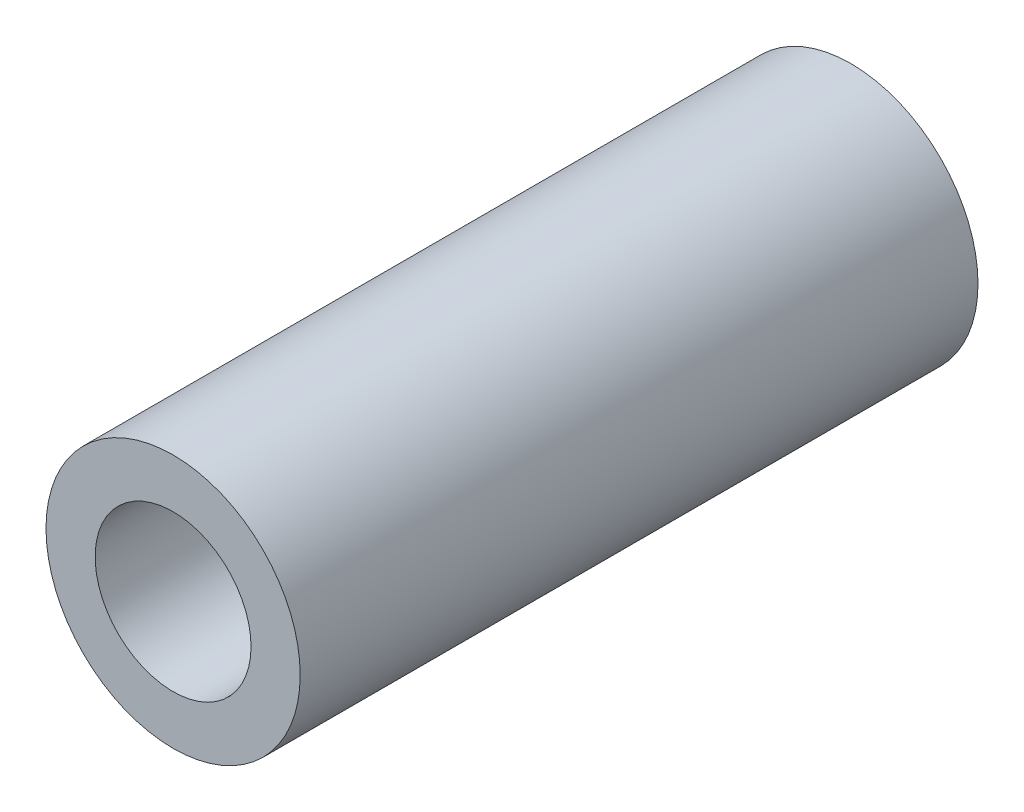
ISO-10303-21;
HEADER;
FILE_DESCRIPTION(('STEP AP214'),'2;1');
FILE_NAME('part.step','',(''),(''),'','','');
FILE_SCHEMA(('AUTOMOTIVE_DESIGN { 1 0 10303 214 1 1 1 1 }'));
ENDSEC;
DATA;
#1=APPLICATION_CONTEXT('core data for automotive mechanical design processes');
#2=APPLICATION_PROTOCOL_DEFINITION('international standard','automotive_design',2000,#1);
#3=PRODUCT_CONTEXT('',#1,'mechanical');
#4=PRODUCT('Part','Part','',(#3));
#5=PRODUCT_RELATED_PRODUCT_CATEGORY('part','',(#4));
#6=PRODUCT_DEFINITION_FORMATION('','',#4);
#7=PRODUCT_DEFINITION_CONTEXT('part definition',#1,'design');
#8=PRODUCT_DEFINITION('design','',#6,#7);
#9=PRODUCT_DEFINITION_SHAPE('','',#8);
#10=(LENGTH_UNIT() NAMED_UNIT(*) SI_UNIT(.MILLI.,.METRE.));
#11=(NAMED_UNIT(*) PLANE_ANGLE_UNIT() SI_UNIT($,.RADIAN.));
#12=(NAMED_UNIT(*) SI_UNIT($,.STERADIAN.) SOLID_ANGLE_UNIT());
#13=UNCERTAINTY_MEASURE_WITH_UNIT(LENGTH_MEASURE(1.E-05),#10,'distance_accuracy_value','');
#14=(GEOMETRIC_REPRESENTATION_CONTEXT(3) GLOBAL_UNCERTAINTY_ASSIGNED_CONTEXT((#13)) GLOBAL_UNIT_ASSIGNED_CONTEXT((#10,
#11,#12)) REPRESENTATION_CONTEXT('',''));
#15=CARTESIAN_POINT('',(0.,0.,0.));
#16=DIRECTION('',(0.,0.,1.));
#17=DIRECTION('',(1.,0.,0.));
#18=AXIS2_PLACEMENT_3D('',#15,#16,#17);
#19=CARTESIAN_POINT('',(0.,0.,6.35));
#20=DIRECTION('',(0.,0.,1.));
#21=DIRECTION('',(1.,0.,0.));
#22=AXIS2_PLACEMENT_3D('',#19,#20,#21);
#23=PLANE('',#22);
#24=CARTESIAN_POINT('',(0.,0.,6.35));
#25=DIRECTION('',(0.,0.,1.));
#26=DIRECTION('',(1.,0.,0.));
#27=AXIS2_PLACEMENT_3D('',#24,#25,#26);
#28=CIRCLE('',#27,2.38125);
#29=CARTESIAN_POINT('',(2.38125,0.,6.35));
#30=VERTEX_POINT('',#29);
#31=EDGE_CURVE('E10',#30,#30,#28,.T.);
#32=ORIENTED_EDGE('',*,*,#31,.T.);
#33=EDGE_LOOP('',(#32));
#34=FACE_BOUND('',#33,.T.);
#35=CARTESIAN_POINT('',(0.,0.,6.35));
#36=DIRECTION('',(0.,0.,1.));
#37=DIRECTION('',(1.,0.,0.));
#38=AXIS2_PLACEMENT_3D('',#35,#36,#37);
#39=CIRCLE('',#38,1.4605);
#40=CARTESIAN_POINT('',(1.4605,0.,6.35));
#41=VERTEX_POINT('',#40);
#42=EDGE_CURVE('E37',#41,#41,#39,.T.);
#43=ORIENTED_EDGE('',*,*,#42,.F.);
#44=EDGE_LOOP('',(#43));
#45=FACE_BOUND('',#44,.T.);
#46=ADVANCED_FACE('F30',(#34,#45),#23,.T.);
#47=CARTESIAN_POINT('',(0.,0.,6.35));
#48=DIRECTION('',(0.,0.,-1.));
#49=DIRECTION('',(-1.,0.,0.));
#50=AXIS2_PLACEMENT_3D('',#47,#48,#49);
#51=CYLINDRICAL_SURFACE('',#50,2.38125);
#52=ORIENTED_EDGE('',*,*,#31,.F.);
#53=EDGE_LOOP('',(#52));
#54=FACE_BOUND('',#53,.T.);
#55=CARTESIAN_POINT('',(0.,0.,-6.35));
#56=DIRECTION('',(0.,0.,1.));
#57=DIRECTION('',(1.,0.,0.));
#58=AXIS2_PLACEMENT_3D('',#55,#56,#57);
#59=CIRCLE('',#58,2.38125);
#60=CARTESIAN_POINT('',(2.38125,0.,-6.35));
#61=VERTEX_POINT('',#60);
#62=EDGE_CURVE('E41',#61,#61,#59,.T.);
#63=ORIENTED_EDGE('',*,*,#62,.T.);
#64=EDGE_LOOP('',(#63));
#65=FACE_BOUND('',#64,.T.);
#66=ADVANCED_FACE('F32',(#54,#65),#51,.T.);
#67=CARTESIAN_POINT('',(0.,0.,6.35));
#68=DIRECTION('',(0.,0.,-1.));
#69=DIRECTION('',(-1.,0.,0.));
#70=AXIS2_PLACEMENT_3D('',#67,#68,#69);
#71=CYLINDRICAL_SURFACE('',#70,1.4605);
#72=ORIENTED_EDGE('',*,*,#42,.T.);
#73=EDGE_LOOP('',(#72));
#74=FACE_BOUND('',#73,.T.);
#75=CARTESIAN_POINT('',(0.,0.,-6.35));
#76=DIRECTION('',(0.,0.,1.));
#77=DIRECTION('',(1.,0.,0.));
#78=AXIS2_PLACEMENT_3D('',#75,#76,#77);
#79=CIRCLE('',#78,1.4605);
#80=CARTESIAN_POINT('',(1.4605,0.,-6.35));
#81=VERTEX_POINT('',#80);
#82=EDGE_CURVE('E45',#81,#81,#79,.T.);
#83=ORIENTED_EDGE('',*,*,#82,.F.);
#84=EDGE_LOOP('',(#83));
#85=FACE_BOUND('',#84,.T.);
#86=ADVANCED_FACE('F54',(#74,#85),#71,.F.);
#87=CARTESIAN_POINT('',(0.,0.,-6.35));
#88=DIRECTION('',(0.,0.,1.));
#89=DIRECTION('',(1.,0.,0.));
#90=AXIS2_PLACEMENT_3D('',#87,#88,#89);
#91=PLANE('',#90);
#92=ORIENTED_EDGE('',*,*,#82,.T.);
#93=EDGE_LOOP('',(#92));
#94=FACE_BOUND('',#93,.T.);
#95=ORIENTED_EDGE('',*,*,#62,.F.);
#96=EDGE_LOOP('',(#95));
#97=FACE_BOUND('',#96,.T.);
#98=ADVANCED_FACE('F51',(#94,#97),#91,.F.);
#99=CLOSED_SHELL('',(#46,#66,#86,#98));
#100=MANIFOLD_SOLID_BREP('B2',#99);
#101=ADVANCED_BREP_SHAPE_REPRESENTATION('',(#18,#100),#14);
#102=SHAPE_DEFINITION_REPRESENTATION(#9,#101);
ENDSEC;
END-ISO-10303-21;
